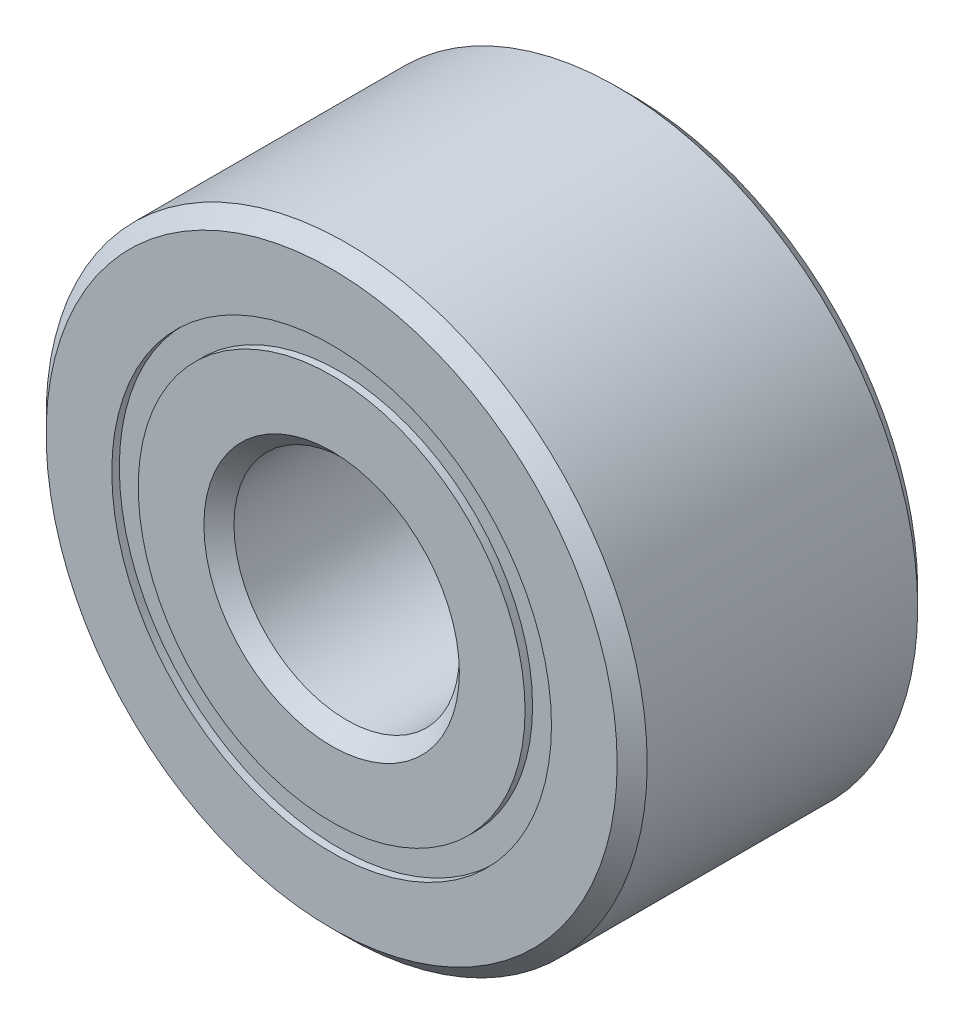
ISO-10303-21;
HEADER;
FILE_DESCRIPTION(('STEP AP214'),'2;1');
FILE_NAME('part.step','',(''),(''),'','','');
FILE_SCHEMA(('AUTOMOTIVE_DESIGN { 1 0 10303 214 1 1 1 1 }'));
ENDSEC;
DATA;
#1=APPLICATION_CONTEXT('core data for automotive mechanical design processes');
#2=APPLICATION_PROTOCOL_DEFINITION('international standard','automotive_design',2000,#1);
#3=PRODUCT_CONTEXT('',#1,'mechanical');
#4=PRODUCT('Part','Part','',(#3));
#5=PRODUCT_RELATED_PRODUCT_CATEGORY('part','',(#4));
#6=PRODUCT_DEFINITION_FORMATION('','',#4);
#7=PRODUCT_DEFINITION_CONTEXT('part definition',#1,'design');
#8=PRODUCT_DEFINITION('design','',#6,#7);
#9=PRODUCT_DEFINITION_SHAPE('','',#8);
#10=(LENGTH_UNIT() NAMED_UNIT(*) SI_UNIT(.MILLI.,.METRE.));
#11=(NAMED_UNIT(*) PLANE_ANGLE_UNIT() SI_UNIT($,.RADIAN.));
#12=(NAMED_UNIT(*) SI_UNIT($,.STERADIAN.) SOLID_ANGLE_UNIT());
#13=UNCERTAINTY_MEASURE_WITH_UNIT(LENGTH_MEASURE(1.E-05),#10,'distance_accuracy_value','');
#14=(GEOMETRIC_REPRESENTATION_CONTEXT(3) GLOBAL_UNCERTAINTY_ASSIGNED_CONTEXT((#13)) GLOBAL_UNIT_ASSIGNED_CONTEXT((#10,
#11,#12)) REPRESENTATION_CONTEXT('',''));
#15=CARTESIAN_POINT('',(0.,0.,0.));
#16=DIRECTION('',(0.,0.,1.));
#17=DIRECTION('',(1.,0.,0.));
#18=AXIS2_PLACEMENT_3D('',#15,#16,#17);
#19=CARTESIAN_POINT('',(0.,2.92582417582418,-1.9));
#20=DIRECTION('',(0.,0.,1.));
#21=DIRECTION('',(1.,0.,0.));
#22=AXIS2_PLACEMENT_3D('',#19,#20,#21);
#23=PLANE('',#22);
#24=CARTESIAN_POINT('',(0.,0.,-1.9));
#25=DIRECTION('',(0.,0.,1.));
#26=DIRECTION('',(1.,0.,0.));
#27=AXIS2_PLACEMENT_3D('',#24,#25,#26);
#28=CIRCLE('',#27,2.92582417582418);
#29=CARTESIAN_POINT('',(2.92582417582418,0.,-1.9));
#30=VERTEX_POINT('',#29);
#31=EDGE_CURVE('E54',#30,#30,#28,.T.);
#32=ORIENTED_EDGE('',*,*,#31,.F.);
#33=EDGE_LOOP('',(#32));
#34=FACE_BOUND('',#33,.T.);
#35=CARTESIAN_POINT('',(0.,0.,-1.9));
#36=DIRECTION('',(0.,0.,1.));
#37=DIRECTION('',(1.,0.,0.));
#38=AXIS2_PLACEMENT_3D('',#35,#36,#37);
#39=CIRCLE('',#38,2.57417582417582);
#40=CARTESIAN_POINT('',(2.57417582417582,0.,-1.9));
#41=VERTEX_POINT('',#40);
#42=EDGE_CURVE('E11',#41,#41,#39,.T.);
#43=ORIENTED_EDGE('',*,*,#42,.T.);
#44=EDGE_LOOP('',(#43));
#45=FACE_BOUND('',#44,.T.);
#46=ADVANCED_FACE('F40',(#34,#45),#23,.F.);
#47=CARTESIAN_POINT('',(0.,0.,2.));
#48=DIRECTION('',(0.,0.,1.));
#49=DIRECTION('',(1.,0.,0.));
#50=AXIS2_PLACEMENT_3D('',#47,#48,#49);
#51=CYLINDRICAL_SURFACE('',#50,2.57417582417582);
#52=ORIENTED_EDGE('',*,*,#42,.F.);
#53=EDGE_LOOP('',(#52));
#54=FACE_BOUND('',#53,.T.);
#55=CARTESIAN_POINT('',(0.,0.,-0.906111250120191));
#56=DIRECTION('',(0.,0.,1.));
#57=DIRECTION('',(1.,0.,0.));
#58=AXIS2_PLACEMENT_3D('',#55,#56,#57);
#59=CIRCLE('',#58,2.57417582417582);
#60=CARTESIAN_POINT('',(2.57417582417582,0.,-0.906111250120191));
#61=VERTEX_POINT('',#60);
#62=EDGE_CURVE('E46',#61,#61,#59,.T.);
#63=ORIENTED_EDGE('',*,*,#62,.T.);
#64=EDGE_LOOP('',(#63));
#65=FACE_BOUND('',#64,.T.);
#66=ADVANCED_FACE('F63',(#54,#65),#51,.F.);
#67=CARTESIAN_POINT('',(0.,2.92582417582418,-0.906111250120191));
#68=DIRECTION('',(0.,0.,-1.));
#69=DIRECTION('',(-1.,0.,0.));
#70=AXIS2_PLACEMENT_3D('',#67,#68,#69);
#71=PLANE('',#70);
#72=ORIENTED_EDGE('',*,*,#62,.F.);
#73=EDGE_LOOP('',(#72));
#74=FACE_BOUND('',#73,.T.);
#75=CARTESIAN_POINT('',(0.,0.,-0.906111250120191));
#76=DIRECTION('',(0.,0.,1.));
#77=DIRECTION('',(1.,0.,0.));
#78=AXIS2_PLACEMENT_3D('',#75,#76,#77);
#79=CIRCLE('',#78,2.92582417582418);
#80=CARTESIAN_POINT('',(2.92582417582418,0.,-0.906111250120191));
#81=VERTEX_POINT('',#80);
#82=EDGE_CURVE('E50',#81,#81,#79,.T.);
#83=ORIENTED_EDGE('',*,*,#82,.T.);
#84=EDGE_LOOP('',(#83));
#85=FACE_BOUND('',#84,.T.);
#86=ADVANCED_FACE('F67',(#74,#85),#71,.F.);
#87=CARTESIAN_POINT('',(0.,0.,2.));
#88=DIRECTION('',(0.,0.,1.));
#89=DIRECTION('',(1.,0.,0.));
#90=AXIS2_PLACEMENT_3D('',#87,#88,#89);
#91=CYLINDRICAL_SURFACE('',#90,2.92582417582418);
#92=ORIENTED_EDGE('',*,*,#82,.F.);
#93=EDGE_LOOP('',(#92));
#94=FACE_BOUND('',#93,.T.);
#95=ORIENTED_EDGE('',*,*,#31,.T.);
#96=EDGE_LOOP('',(#95));
#97=FACE_BOUND('',#96,.T.);
#98=ADVANCED_FACE('F60',(#94,#97),#91,.T.);
#99=CLOSED_SHELL('',(#46,#66,#86,#98));
#100=MANIFOLD_SOLID_BREP('B2',#99);
#101=CARTESIAN_POINT('',(0.,2.92582417582418,1.9));
#102=DIRECTION('',(0.,0.,-1.));
#103=DIRECTION('',(-1.,0.,0.));
#104=AXIS2_PLACEMENT_3D('',#101,#102,#103);
#105=PLANE('',#104);
#106=CARTESIAN_POINT('',(0.,0.,1.9));
#107=DIRECTION('',(0.,0.,1.));
#108=DIRECTION('',(1.,0.,0.));
#109=AXIS2_PLACEMENT_3D('',#106,#107,#108);
#110=CIRCLE('',#109,2.57417582417582);
#111=CARTESIAN_POINT('',(2.57417582417582,0.,1.9));
#112=VERTEX_POINT('',#111);
#113=EDGE_CURVE('E39',#112,#112,#110,.T.);
#114=ORIENTED_EDGE('',*,*,#113,.F.);
#115=EDGE_LOOP('',(#114));
#116=FACE_BOUND('',#115,.T.);
#117=CARTESIAN_POINT('',(0.,0.,1.9));
#118=DIRECTION('',(0.,0.,1.));
#119=DIRECTION('',(1.,0.,0.));
#120=AXIS2_PLACEMENT_3D('',#117,#118,#119);
#121=CIRCLE('',#120,2.92582417582418);
#122=CARTESIAN_POINT('',(2.92582417582418,0.,1.9));
#123=VERTEX_POINT('',#122);
#124=EDGE_CURVE('E122',#123,#123,#121,.T.);
#125=ORIENTED_EDGE('',*,*,#124,.T.);
#126=EDGE_LOOP('',(#125));
#127=FACE_BOUND('',#126,.T.);
#128=ADVANCED_FACE('F108',(#116,#127),#105,.F.);
#129=CARTESIAN_POINT('',(0.,0.,2.));
#130=DIRECTION('',(0.,0.,1.));
#131=DIRECTION('',(1.,0.,0.));
#132=AXIS2_PLACEMENT_3D('',#129,#130,#131);
#133=CYLINDRICAL_SURFACE('',#132,2.57417582417582);
#134=CARTESIAN_POINT('',(0.,0.,0.906111250120189));
#135=DIRECTION('',(0.,0.,1.));
#136=DIRECTION('',(1.,0.,0.));
#137=AXIS2_PLACEMENT_3D('',#134,#135,#136);
#138=CIRCLE('',#137,2.57417582417582);
#139=CARTESIAN_POINT('',(2.57417582417582,0.,0.906111250120189));
#140=VERTEX_POINT('',#139);
#141=EDGE_CURVE('E114',#140,#140,#138,.T.);
#142=ORIENTED_EDGE('',*,*,#141,.F.);
#143=EDGE_LOOP('',(#142));
#144=FACE_BOUND('',#143,.T.);
#145=ORIENTED_EDGE('',*,*,#113,.T.);
#146=EDGE_LOOP('',(#145));
#147=FACE_BOUND('',#146,.T.);
#148=ADVANCED_FACE('F137',(#144,#147),#133,.F.);
#149=CARTESIAN_POINT('',(0.,2.92582417582418,0.906111250120189));
#150=DIRECTION('',(0.,0.,1.));
#151=DIRECTION('',(1.,0.,0.));
#152=AXIS2_PLACEMENT_3D('',#149,#150,#151);
#153=PLANE('',#152);
#154=CARTESIAN_POINT('',(0.,0.,0.90611125012019));
#155=DIRECTION('',(0.,0.,1.));
#156=DIRECTION('',(1.,0.,0.));
#157=AXIS2_PLACEMENT_3D('',#154,#155,#156);
#158=CIRCLE('',#157,2.92582417582418);
#159=CARTESIAN_POINT('',(2.92582417582418,0.,0.90611125012019));
#160=VERTEX_POINT('',#159);
#161=EDGE_CURVE('E118',#160,#160,#158,.T.);
#162=ORIENTED_EDGE('',*,*,#161,.F.);
#163=EDGE_LOOP('',(#162));
#164=FACE_BOUND('',#163,.T.);
#165=ORIENTED_EDGE('',*,*,#141,.T.);
#166=EDGE_LOOP('',(#165));
#167=FACE_BOUND('',#166,.T.);
#168=ADVANCED_FACE('F132',(#164,#167),#153,.F.);
#169=CARTESIAN_POINT('',(0.,0.,2.));
#170=DIRECTION('',(0.,0.,1.));
#171=DIRECTION('',(1.,0.,0.));
#172=AXIS2_PLACEMENT_3D('',#169,#170,#171);
#173=CYLINDRICAL_SURFACE('',#172,2.92582417582418);
#174=ORIENTED_EDGE('',*,*,#124,.F.);
#175=EDGE_LOOP('',(#174));
#176=FACE_BOUND('',#175,.T.);
#177=ORIENTED_EDGE('',*,*,#161,.T.);
#178=EDGE_LOOP('',(#177));
#179=FACE_BOUND('',#178,.T.);
#180=ADVANCED_FACE('F129',(#176,#179),#173,.T.);
#181=CLOSED_SHELL('',(#128,#148,#168,#180));
#182=MANIFOLD_SOLID_BREP('B6',#181);
#183=CARTESIAN_POINT('',(-1.37499999999997,2.38156986040722,0.));
#184=DIRECTION('',(0.,0.,1.));
#185=DIRECTION('',(-0.499999999999989,0.866025403784445,0.));
#186=AXIS2_PLACEMENT_3D('',#183,#184,#185);
#187=SPHERICAL_SURFACE('',#186,0.90611125012019);
#188=CARTESIAN_POINT('',(-1.37499999999997,2.38156986040722,0.90611125012019));
#189=VERTEX_POINT('',#188);
#190=VERTEX_LOOP('',#189);
#191=FACE_BOUND('',#190,.T.);
#192=ADVANCED_FACE('F175',(#191),#187,.T.);
#193=CLOSED_SHELL('',(#192));
#194=MANIFOLD_SOLID_BREP('B34',#193);
#195=CARTESIAN_POINT('',(-2.38156986040719,1.37500000000003,0.));
#196=DIRECTION('',(0.,0.,1.));
#197=DIRECTION('',(-0.866025403784433,0.50000000000001,0.));
#198=AXIS2_PLACEMENT_3D('',#195,#196,#197);
#199=SPHERICAL_SURFACE('',#198,0.90611125012019);
#200=CARTESIAN_POINT('',(-2.38156986040719,1.37500000000003,0.90611125012019));
#201=VERTEX_POINT('',#200);
#202=VERTEX_LOOP('',#201);
#203=FACE_BOUND('',#202,.T.);
#204=ADVANCED_FACE('F195',(#203),#199,.T.);
#205=CLOSED_SHELL('',(#204));
#206=MANIFOLD_SOLID_BREP('B104',#205);
#207=CARTESIAN_POINT('',(-2.75,0.,0.));
#208=DIRECTION('',(0.,0.,1.));
#209=DIRECTION('',(-1.,0.,0.));
#210=AXIS2_PLACEMENT_3D('',#207,#208,#209);
#211=SPHERICAL_SURFACE('',#210,0.90611125012019);
#212=CARTESIAN_POINT('',(-2.75,0.,0.90611125012019));
#213=VERTEX_POINT('',#212);
#214=VERTEX_LOOP('',#213);
#215=FACE_BOUND('',#214,.T.);
#216=ADVANCED_FACE('F215',(#215),#211,.T.);
#217=CLOSED_SHELL('',(#216));
#218=MANIFOLD_SOLID_BREP('B171',#217);
#219=CARTESIAN_POINT('',(-2.38156986040722,-1.37499999999998,0.));
#220=DIRECTION('',(0.,0.,1.));
#221=DIRECTION('',(-0.866025403784443,-0.499999999999992,0.));
#222=AXIS2_PLACEMENT_3D('',#219,#220,#221);
#223=SPHERICAL_SURFACE('',#222,0.90611125012019);
#224=CARTESIAN_POINT('',(-2.38156986040722,-1.37499999999998,0.90611125012019));
#225=VERTEX_POINT('',#224);
#226=VERTEX_LOOP('',#225);
#227=FACE_BOUND('',#226,.T.);
#228=ADVANCED_FACE('F235',(#227),#223,.T.);
#229=CLOSED_SHELL('',(#228));
#230=MANIFOLD_SOLID_BREP('B191',#229);
#231=CARTESIAN_POINT('',(-1.37500000000002,-2.3815698604072,0.));
#232=DIRECTION('',(0.,0.,1.));
#233=DIRECTION('',(-0.500000000000007,-0.866025403784435,0.));
#234=AXIS2_PLACEMENT_3D('',#231,#232,#233);
#235=SPHERICAL_SURFACE('',#234,0.90611125012019);
#236=CARTESIAN_POINT('',(-1.37500000000002,-2.3815698604072,0.90611125012019));
#237=VERTEX_POINT('',#236);
#238=VERTEX_LOOP('',#237);
#239=FACE_BOUND('',#238,.T.);
#240=ADVANCED_FACE('F255',(#239),#235,.T.);
#241=CLOSED_SHELL('',(#240));
#242=MANIFOLD_SOLID_BREP('B211',#241);
#243=CARTESIAN_POINT('',(0.,-2.75,0.));
#244=DIRECTION('',(0.,0.,1.));
#245=DIRECTION('',(0.,-1.,0.));
#246=AXIS2_PLACEMENT_3D('',#243,#244,#245);
#247=SPHERICAL_SURFACE('',#246,0.90611125012019);
#248=CARTESIAN_POINT('',(0.,-2.75,0.90611125012019));
#249=VERTEX_POINT('',#248);
#250=VERTEX_LOOP('',#249);
#251=FACE_BOUND('',#250,.T.);
#252=ADVANCED_FACE('F275',(#251),#247,.T.);
#253=CLOSED_SHELL('',(#252));
#254=MANIFOLD_SOLID_BREP('B231',#253);
#255=CARTESIAN_POINT('',(1.37499999999999,-2.38156986040721,0.));
#256=DIRECTION('',(0.,0.,1.));
#257=DIRECTION('',(0.499999999999995,-0.866025403784442,0.));
#258=AXIS2_PLACEMENT_3D('',#255,#256,#257);
#259=SPHERICAL_SURFACE('',#258,0.90611125012019);
#260=CARTESIAN_POINT('',(1.37499999999999,-2.38156986040721,0.90611125012019));
#261=VERTEX_POINT('',#260);
#262=VERTEX_LOOP('',#261);
#263=FACE_BOUND('',#262,.T.);
#264=ADVANCED_FACE('F295',(#263),#259,.T.);
#265=CLOSED_SHELL('',(#264));
#266=MANIFOLD_SOLID_BREP('B251',#265);
#267=CARTESIAN_POINT('',(2.3815698604072,-1.37500000000001,0.));
#268=DIRECTION('',(0.,0.,1.));
#269=DIRECTION('',(0.866025403784436,-0.500000000000004,0.));
#270=AXIS2_PLACEMENT_3D('',#267,#268,#269);
#271=SPHERICAL_SURFACE('',#270,0.90611125012019);
#272=CARTESIAN_POINT('',(2.3815698604072,-1.37500000000001,0.90611125012019));
#273=VERTEX_POINT('',#272);
#274=VERTEX_LOOP('',#273);
#275=FACE_BOUND('',#274,.T.);
#276=ADVANCED_FACE('F315',(#275),#271,.T.);
#277=CLOSED_SHELL('',(#276));
#278=MANIFOLD_SOLID_BREP('B271',#277);
#279=CARTESIAN_POINT('',(2.75,0.,0.));
#280=DIRECTION('',(0.,0.,1.));
#281=DIRECTION('',(1.,0.,0.));
#282=AXIS2_PLACEMENT_3D('',#279,#280,#281);
#283=SPHERICAL_SURFACE('',#282,0.90611125012019);
#284=CARTESIAN_POINT('',(2.75,0.,0.90611125012019));
#285=VERTEX_POINT('',#284);
#286=VERTEX_LOOP('',#285);
#287=FACE_BOUND('',#286,.T.);
#288=ADVANCED_FACE('F335',(#287),#283,.T.);
#289=CLOSED_SHELL('',(#288));
#290=MANIFOLD_SOLID_BREP('B291',#289);
#291=CARTESIAN_POINT('',(2.38156986040721,1.37499999999999,0.));
#292=DIRECTION('',(0.,0.,1.));
#293=DIRECTION('',(0.86602540378444,0.499999999999998,0.));
#294=AXIS2_PLACEMENT_3D('',#291,#292,#293);
#295=SPHERICAL_SURFACE('',#294,0.90611125012019);
#296=CARTESIAN_POINT('',(2.38156986040721,1.37499999999999,0.90611125012019));
#297=VERTEX_POINT('',#296);
#298=VERTEX_LOOP('',#297);
#299=FACE_BOUND('',#298,.T.);
#300=ADVANCED_FACE('F355',(#299),#295,.T.);
#301=CLOSED_SHELL('',(#300));
#302=MANIFOLD_SOLID_BREP('B311',#301);
#303=CARTESIAN_POINT('',(1.375,2.3815698604072,0.));
#304=DIRECTION('',(0.,0.,1.));
#305=DIRECTION('',(0.500000000000001,0.866025403784438,0.));
#306=AXIS2_PLACEMENT_3D('',#303,#304,#305);
#307=SPHERICAL_SURFACE('',#306,0.90611125012019);
#308=CARTESIAN_POINT('',(1.375,2.3815698604072,0.90611125012019));
#309=VERTEX_POINT('',#308);
#310=VERTEX_LOOP('',#309);
#311=FACE_BOUND('',#310,.T.);
#312=ADVANCED_FACE('F375',(#311),#307,.T.);
#313=CLOSED_SHELL('',(#312));
#314=MANIFOLD_SOLID_BREP('B331',#313);
#315=CARTESIAN_POINT('',(0.,2.75,0.));
#316=DIRECTION('',(0.,0.,1.));
#317=DIRECTION('',(0.,1.,0.));
#318=AXIS2_PLACEMENT_3D('',#315,#316,#317);
#319=SPHERICAL_SURFACE('',#318,0.90611125012019);
#320=CARTESIAN_POINT('',(0.,2.75,0.90611125012019));
#321=VERTEX_POINT('',#320);
#322=VERTEX_LOOP('',#321);
#323=FACE_BOUND('',#322,.T.);
#324=ADVANCED_FACE('F398',(#323),#319,.T.);
#325=CLOSED_SHELL('',(#324));
#326=MANIFOLD_SOLID_BREP('B351',#325);
#327=CARTESIAN_POINT('',(0.,2.57417582417582,2.));
#328=DIRECTION('',(0.,0.,-1.));
#329=DIRECTION('',(-1.,0.,0.));
#330=AXIS2_PLACEMENT_3D('',#327,#328,#329);
#331=PLANE('',#330);
#332=CARTESIAN_POINT('',(0.,0.,2.));
#333=DIRECTION('',(0.,0.,1.));
#334=DIRECTION('',(1.,0.,0.));
#335=AXIS2_PLACEMENT_3D('',#332,#333,#334);
#336=CIRCLE('',#335,1.7);
#337=CARTESIAN_POINT('',(1.7,0.,2.));
#338=VERTEX_POINT('',#337);
#339=EDGE_CURVE('E446',#338,#338,#336,.T.);
#340=ORIENTED_EDGE('',*,*,#339,.F.);
#341=EDGE_LOOP('',(#340));
#342=FACE_BOUND('',#341,.T.);
#343=CARTESIAN_POINT('',(0.,0.,2.));
#344=DIRECTION('',(0.,0.,1.));
#345=DIRECTION('',(1.,0.,0.));
#346=AXIS2_PLACEMENT_3D('',#343,#344,#345);
#347=CIRCLE('',#346,2.57417582417582);
#348=CARTESIAN_POINT('',(2.57417582417582,0.,2.));
#349=VERTEX_POINT('',#348);
#350=EDGE_CURVE('E397',#349,#349,#347,.T.);
#351=ORIENTED_EDGE('',*,*,#350,.T.);
#352=EDGE_LOOP('',(#351));
#353=FACE_BOUND('',#352,.T.);
#354=ADVANCED_FACE('F418',(#342,#353),#331,.F.);
#355=CARTESIAN_POINT('',(0.,0.,2.));
#356=DIRECTION('',(0.,0.,1.));
#357=DIRECTION('',(1.,0.,0.));
#358=AXIS2_PLACEMENT_3D('',#355,#356,#357);
#359=CYLINDRICAL_SURFACE('',#358,2.57417582417582);
#360=ORIENTED_EDGE('',*,*,#350,.F.);
#361=EDGE_LOOP('',(#360));
#362=FACE_BOUND('',#361,.T.);
#363=CARTESIAN_POINT('',(0.,0.,0.888888888888888));
#364=DIRECTION('',(0.,0.,1.));
#365=DIRECTION('',(1.,0.,0.));
#366=AXIS2_PLACEMENT_3D('',#363,#364,#365);
#367=CIRCLE('',#366,2.57417582417582);
#368=CARTESIAN_POINT('',(2.57417582417582,0.,0.888888888888888));
#369=VERTEX_POINT('',#368);
#370=EDGE_CURVE('E424',#369,#369,#367,.T.);
#371=ORIENTED_EDGE('',*,*,#370,.T.);
#372=EDGE_LOOP('',(#371));
#373=FACE_BOUND('',#372,.T.);
#374=ADVANCED_FACE('F453',(#362,#373),#359,.T.);
#375=CARTESIAN_POINT('',(0.,0.,0.));
#376=DIRECTION('',(0.,0.,1.));
#377=DIRECTION('',(1.,0.,0.));
#378=AXIS2_PLACEMENT_3D('',#375,#376,#377);
#379=TOROIDAL_SURFACE('',#378,2.74999999999999,0.906111250120189);
#380=ORIENTED_EDGE('',*,*,#370,.F.);
#381=EDGE_LOOP('',(#380));
#382=FACE_BOUND('',#381,.T.);
#383=CARTESIAN_POINT('',(0.,0.,-0.88888888888889));
#384=DIRECTION('',(0.,0.,1.));
#385=DIRECTION('',(1.,0.,0.));
#386=AXIS2_PLACEMENT_3D('',#383,#384,#385);
#387=CIRCLE('',#386,2.57417582417582);
#388=CARTESIAN_POINT('',(2.57417582417582,0.,-0.88888888888889));
#389=VERTEX_POINT('',#388);
#390=EDGE_CURVE('E428',#389,#389,#387,.T.);
#391=ORIENTED_EDGE('',*,*,#390,.T.);
#392=EDGE_LOOP('',(#391));
#393=FACE_BOUND('',#392,.T.);
#394=ADVANCED_FACE('F457',(#382,#393),#379,.F.);
#395=CARTESIAN_POINT('',(0.,0.,2.));
#396=DIRECTION('',(0.,0.,1.));
#397=DIRECTION('',(1.,0.,0.));
#398=AXIS2_PLACEMENT_3D('',#395,#396,#397);
#399=CYLINDRICAL_SURFACE('',#398,2.57417582417582);
#400=ORIENTED_EDGE('',*,*,#390,.F.);
#401=EDGE_LOOP('',(#400));
#402=FACE_BOUND('',#401,.T.);
#403=CARTESIAN_POINT('',(0.,0.,-2.));
#404=DIRECTION('',(0.,0.,1.));
#405=DIRECTION('',(1.,0.,0.));
#406=AXIS2_PLACEMENT_3D('',#403,#404,#405);
#407=CIRCLE('',#406,2.57417582417582);
#408=CARTESIAN_POINT('',(2.57417582417582,0.,-2.));
#409=VERTEX_POINT('',#408);
#410=EDGE_CURVE('E432',#409,#409,#407,.T.);
#411=ORIENTED_EDGE('',*,*,#410,.T.);
#412=EDGE_LOOP('',(#411));
#413=FACE_BOUND('',#412,.T.);
#414=ADVANCED_FACE('F462',(#402,#413),#399,.T.);
#415=CARTESIAN_POINT('',(0.,1.7,-2.));
#416=DIRECTION('',(0.,0.,1.));
#417=DIRECTION('',(1.,0.,0.));
#418=AXIS2_PLACEMENT_3D('',#415,#416,#417);
#419=PLANE('',#418);
#420=ORIENTED_EDGE('',*,*,#410,.F.);
#421=EDGE_LOOP('',(#420));
#422=FACE_BOUND('',#421,.T.);
#423=CARTESIAN_POINT('',(0.,0.,-2.));
#424=DIRECTION('',(0.,0.,1.));
#425=DIRECTION('',(1.,0.,0.));
#426=AXIS2_PLACEMENT_3D('',#423,#424,#425);
#427=CIRCLE('',#426,1.7);
#428=CARTESIAN_POINT('',(1.7,0.,-2.));
#429=VERTEX_POINT('',#428);
#430=EDGE_CURVE('E437',#429,#429,#427,.T.);
#431=ORIENTED_EDGE('',*,*,#430,.T.);
#432=EDGE_LOOP('',(#431));
#433=FACE_BOUND('',#432,.T.);
#434=ADVANCED_FACE('F468',(#422,#433),#419,.F.);
#435=CARTESIAN_POINT('',(0.,0.,-1.8));
#436=DIRECTION('',(0.,0.,-1.));
#437=DIRECTION('',(-1.,0.,0.));
#438=AXIS2_PLACEMENT_3D('',#435,#436,#437);
#439=CONICAL_SURFACE('',#438,1.5,0.78539816339745);
#440=ORIENTED_EDGE('',*,*,#430,.F.);
#441=EDGE_LOOP('',(#440));
#442=FACE_BOUND('',#441,.T.);
#443=CARTESIAN_POINT('',(0.,0.,-1.8));
#444=DIRECTION('',(0.,0.,1.));
#445=DIRECTION('',(1.,0.,0.));
#446=AXIS2_PLACEMENT_3D('',#443,#444,#445);
#447=CIRCLE('',#446,1.5);
#448=CARTESIAN_POINT('',(1.5,0.,-1.8));
#449=VERTEX_POINT('',#448);
#450=EDGE_CURVE('E440',#449,#449,#447,.T.);
#451=ORIENTED_EDGE('',*,*,#450,.T.);
#452=EDGE_LOOP('',(#451));
#453=FACE_BOUND('',#452,.T.);
#454=ADVANCED_FACE('F472',(#442,#453),#439,.F.);
#455=CARTESIAN_POINT('',(0.,0.,2.));
#456=DIRECTION('',(0.,0.,1.));
#457=DIRECTION('',(1.,0.,0.));
#458=AXIS2_PLACEMENT_3D('',#455,#456,#457);
#459=CYLINDRICAL_SURFACE('',#458,1.5);
#460=ORIENTED_EDGE('',*,*,#450,.F.);
#461=EDGE_LOOP('',(#460));
#462=FACE_BOUND('',#461,.T.);
#463=CARTESIAN_POINT('',(0.,0.,1.8));
#464=DIRECTION('',(0.,0.,1.));
#465=DIRECTION('',(1.,0.,0.));
#466=AXIS2_PLACEMENT_3D('',#463,#464,#465);
#467=CIRCLE('',#466,1.5);
#468=CARTESIAN_POINT('',(1.5,0.,1.8));
#469=VERTEX_POINT('',#468);
#470=EDGE_CURVE('E443',#469,#469,#467,.T.);
#471=ORIENTED_EDGE('',*,*,#470,.T.);
#472=EDGE_LOOP('',(#471));
#473=FACE_BOUND('',#472,.T.);
#474=ADVANCED_FACE('F476',(#462,#473),#459,.F.);
#475=CARTESIAN_POINT('',(0.,0.,2.));
#476=DIRECTION('',(0.,0.,1.));
#477=DIRECTION('',(1.,0.,0.));
#478=AXIS2_PLACEMENT_3D('',#475,#476,#477);
#479=CONICAL_SURFACE('',#478,1.7,0.785398163397446);
#480=ORIENTED_EDGE('',*,*,#470,.F.);
#481=EDGE_LOOP('',(#480));
#482=FACE_BOUND('',#481,.T.);
#483=ORIENTED_EDGE('',*,*,#339,.T.);
#484=EDGE_LOOP('',(#483));
#485=FACE_BOUND('',#484,.T.);
#486=ADVANCED_FACE('F450',(#482,#485),#479,.F.);
#487=CLOSED_SHELL('',(#354,#374,#394,#414,#434,#454,#474,#486));
#488=MANIFOLD_SOLID_BREP('B371',#487);
#489=CARTESIAN_POINT('',(0.,0.,1.8));
#490=DIRECTION('',(0.,0.,-1.));
#491=DIRECTION('',(-1.,0.,0.));
#492=AXIS2_PLACEMENT_3D('',#489,#490,#491);
#493=CONICAL_SURFACE('',#492,4.,0.785398163397449);
#494=CARTESIAN_POINT('',(0.,0.,2.));
#495=DIRECTION('',(0.,0.,1.));
#496=DIRECTION('',(1.,0.,0.));
#497=AXIS2_PLACEMENT_3D('',#494,#495,#496);
#498=CIRCLE('',#497,3.8);
#499=CARTESIAN_POINT('',(3.8,0.,2.));
#500=VERTEX_POINT('',#499);
#501=EDGE_CURVE('E568',#500,#500,#498,.T.);
#502=ORIENTED_EDGE('',*,*,#501,.F.);
#503=EDGE_LOOP('',(#502));
#504=FACE_BOUND('',#503,.T.);
#505=CARTESIAN_POINT('',(0.,0.,1.8));
#506=DIRECTION('',(0.,0.,1.));
#507=DIRECTION('',(1.,0.,0.));
#508=AXIS2_PLACEMENT_3D('',#505,#506,#507);
#509=CIRCLE('',#508,4.);
#510=CARTESIAN_POINT('',(4.,0.,1.8));
#511=VERTEX_POINT('',#510);
#512=EDGE_CURVE('E417',#511,#511,#509,.T.);
#513=ORIENTED_EDGE('',*,*,#512,.T.);
#514=EDGE_LOOP('',(#513));
#515=FACE_BOUND('',#514,.T.);
#516=ADVANCED_FACE('F540',(#504,#515),#493,.T.);
#517=CARTESIAN_POINT('',(0.,0.,2.));
#518=DIRECTION('',(0.,0.,1.));
#519=DIRECTION('',(1.,0.,0.));
#520=AXIS2_PLACEMENT_3D('',#517,#518,#519);
#521=CYLINDRICAL_SURFACE('',#520,4.);
#522=ORIENTED_EDGE('',*,*,#512,.F.);
#523=EDGE_LOOP('',(#522));
#524=FACE_BOUND('',#523,.T.);
#525=CARTESIAN_POINT('',(0.,0.,-1.8));
#526=DIRECTION('',(0.,0.,1.));
#527=DIRECTION('',(1.,0.,0.));
#528=AXIS2_PLACEMENT_3D('',#525,#526,#527);
#529=CIRCLE('',#528,4.);
#530=CARTESIAN_POINT('',(4.,0.,-1.8));
#531=VERTEX_POINT('',#530);
#532=EDGE_CURVE('E546',#531,#531,#529,.T.);
#533=ORIENTED_EDGE('',*,*,#532,.T.);
#534=EDGE_LOOP('',(#533));
#535=FACE_BOUND('',#534,.T.);
#536=ADVANCED_FACE('F575',(#524,#535),#521,.T.);
#537=CARTESIAN_POINT('',(0.,0.,-2.));
#538=DIRECTION('',(0.,0.,1.));
#539=DIRECTION('',(1.,0.,0.));
#540=AXIS2_PLACEMENT_3D('',#537,#538,#539);
#541=CONICAL_SURFACE('',#540,3.8,0.78539816339745);
#542=ORIENTED_EDGE('',*,*,#532,.F.);
#543=EDGE_LOOP('',(#542));
#544=FACE_BOUND('',#543,.T.);
#545=CARTESIAN_POINT('',(0.,0.,-2.));
#546=DIRECTION('',(0.,0.,1.));
#547=DIRECTION('',(1.,0.,0.));
#548=AXIS2_PLACEMENT_3D('',#545,#546,#547);
#549=CIRCLE('',#548,3.8);
#550=CARTESIAN_POINT('',(3.8,0.,-2.));
#551=VERTEX_POINT('',#550);
#552=EDGE_CURVE('E550',#551,#551,#549,.T.);
#553=ORIENTED_EDGE('',*,*,#552,.T.);
#554=EDGE_LOOP('',(#553));
#555=FACE_BOUND('',#554,.T.);
#556=ADVANCED_FACE('F579',(#544,#555),#541,.T.);
#557=CARTESIAN_POINT('',(0.,3.8,-2.));
#558=DIRECTION('',(0.,0.,1.));
#559=DIRECTION('',(1.,0.,0.));
#560=AXIS2_PLACEMENT_3D('',#557,#558,#559);
#561=PLANE('',#560);
#562=ORIENTED_EDGE('',*,*,#552,.F.);
#563=EDGE_LOOP('',(#562));
#564=FACE_BOUND('',#563,.T.);
#565=CARTESIAN_POINT('',(0.,0.,-2.));
#566=DIRECTION('',(0.,0.,1.));
#567=DIRECTION('',(1.,0.,0.));
#568=AXIS2_PLACEMENT_3D('',#565,#566,#567);
#569=CIRCLE('',#568,2.92582417582418);
#570=CARTESIAN_POINT('',(2.92582417582418,0.,-2.));
#571=VERTEX_POINT('',#570);
#572=EDGE_CURVE('E554',#571,#571,#569,.T.);
#573=ORIENTED_EDGE('',*,*,#572,.T.);
#574=EDGE_LOOP('',(#573));
#575=FACE_BOUND('',#574,.T.);
#576=ADVANCED_FACE('F584',(#564,#575),#561,.F.);
#577=CARTESIAN_POINT('',(0.,0.,2.));
#578=DIRECTION('',(0.,0.,1.));
#579=DIRECTION('',(1.,0.,0.));
#580=AXIS2_PLACEMENT_3D('',#577,#578,#579);
#581=CYLINDRICAL_SURFACE('',#580,2.92582417582418);
#582=ORIENTED_EDGE('',*,*,#572,.F.);
#583=EDGE_LOOP('',(#582));
#584=FACE_BOUND('',#583,.T.);
#585=CARTESIAN_POINT('',(0.,0.,-0.88888888888889));
#586=DIRECTION('',(0.,0.,1.));
#587=DIRECTION('',(1.,0.,0.));
#588=AXIS2_PLACEMENT_3D('',#585,#586,#587);
#589=CIRCLE('',#588,2.92582417582418);
#590=CARTESIAN_POINT('',(2.92582417582418,0.,-0.88888888888889));
#591=VERTEX_POINT('',#590);
#592=EDGE_CURVE('E559',#591,#591,#589,.T.);
#593=ORIENTED_EDGE('',*,*,#592,.T.);
#594=EDGE_LOOP('',(#593));
#595=FACE_BOUND('',#594,.T.);
#596=ADVANCED_FACE('F590',(#584,#595),#581,.F.);
#597=CARTESIAN_POINT('',(0.,0.,0.));
#598=DIRECTION('',(0.,0.,1.));
#599=DIRECTION('',(1.,0.,0.));
#600=AXIS2_PLACEMENT_3D('',#597,#598,#599);
#601=TOROIDAL_SURFACE('',#600,2.75,0.90611125012019);
#602=ORIENTED_EDGE('',*,*,#592,.F.);
#603=EDGE_LOOP('',(#602));
#604=FACE_BOUND('',#603,.T.);
#605=CARTESIAN_POINT('',(0.,0.,0.888888888888888));
#606=DIRECTION('',(0.,0.,1.));
#607=DIRECTION('',(1.,0.,0.));
#608=AXIS2_PLACEMENT_3D('',#605,#606,#607);
#609=CIRCLE('',#608,2.92582417582418);
#610=CARTESIAN_POINT('',(2.92582417582418,0.,0.888888888888888));
#611=VERTEX_POINT('',#610);
#612=EDGE_CURVE('E562',#611,#611,#609,.T.);
#613=ORIENTED_EDGE('',*,*,#612,.T.);
#614=EDGE_LOOP('',(#613));
#615=FACE_BOUND('',#614,.T.);
#616=ADVANCED_FACE('F594',(#604,#615),#601,.F.);
#617=CARTESIAN_POINT('',(0.,0.,2.));
#618=DIRECTION('',(0.,0.,1.));
#619=DIRECTION('',(1.,0.,0.));
#620=AXIS2_PLACEMENT_3D('',#617,#618,#619);
#621=CYLINDRICAL_SURFACE('',#620,2.92582417582418);
#622=ORIENTED_EDGE('',*,*,#612,.F.);
#623=EDGE_LOOP('',(#622));
#624=FACE_BOUND('',#623,.T.);
#625=CARTESIAN_POINT('',(0.,0.,2.));
#626=DIRECTION('',(0.,0.,1.));
#627=DIRECTION('',(1.,0.,0.));
#628=AXIS2_PLACEMENT_3D('',#625,#626,#627);
#629=CIRCLE('',#628,2.92582417582418);
#630=CARTESIAN_POINT('',(2.92582417582418,0.,2.));
#631=VERTEX_POINT('',#630);
#632=EDGE_CURVE('E565',#631,#631,#629,.T.);
#633=ORIENTED_EDGE('',*,*,#632,.T.);
#634=EDGE_LOOP('',(#633));
#635=FACE_BOUND('',#634,.T.);
#636=ADVANCED_FACE('F598',(#624,#635),#621,.F.);
#637=CARTESIAN_POINT('',(0.,3.8,2.));
#638=DIRECTION('',(0.,0.,-1.));
#639=DIRECTION('',(-1.,0.,0.));
#640=AXIS2_PLACEMENT_3D('',#637,#638,#639);
#641=PLANE('',#640);
#642=ORIENTED_EDGE('',*,*,#632,.F.);
#643=EDGE_LOOP('',(#642));
#644=FACE_BOUND('',#643,.T.);
#645=ORIENTED_EDGE('',*,*,#501,.T.);
#646=EDGE_LOOP('',(#645));
#647=FACE_BOUND('',#646,.T.);
#648=ADVANCED_FACE('F572',(#644,#647),#641,.F.);
#649=CLOSED_SHELL('',(#516,#536,#556,#576,#596,#616,#636,#648));
#650=MANIFOLD_SOLID_BREP('B392',#649);
#651=ADVANCED_BREP_SHAPE_REPRESENTATION('',(#18,#100,#182,#194,#206,#218,#230,#242,#254,#266,
#278,#290,#302,#314,#326,#488,#650),#14);
#652=SHAPE_DEFINITION_REPRESENTATION(#9,#651);
ENDSEC;
END-ISO-10303-21;
